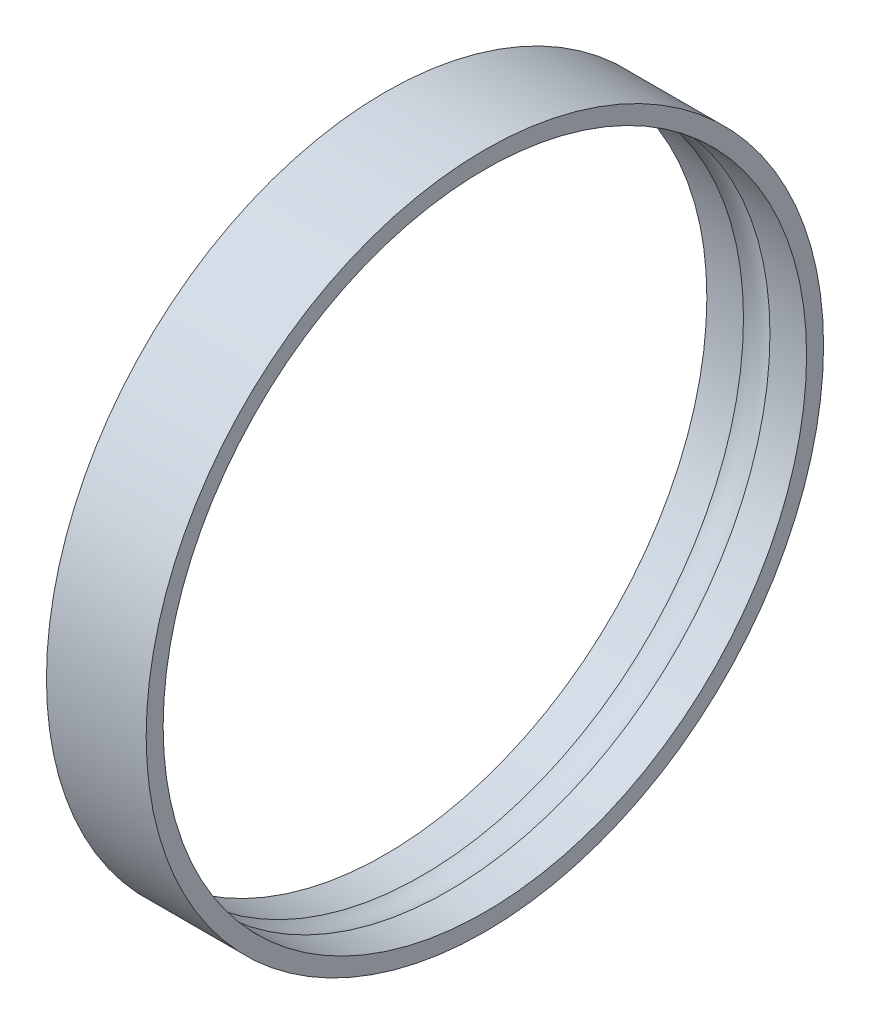
ISO-10303-21;
HEADER;
FILE_DESCRIPTION(('STEP AP214'),'2;1');
FILE_NAME('part.step','',(''),(''),'','','');
FILE_SCHEMA(('AUTOMOTIVE_DESIGN { 1 0 10303 214 1 1 1 1 }'));
ENDSEC;
DATA;
#1=APPLICATION_CONTEXT('core data for automotive mechanical design processes');
#2=APPLICATION_PROTOCOL_DEFINITION('international standard','automotive_design',2000,#1);
#3=PRODUCT_CONTEXT('',#1,'mechanical');
#4=PRODUCT('Part','Part','',(#3));
#5=PRODUCT_RELATED_PRODUCT_CATEGORY('part','',(#4));
#6=PRODUCT_DEFINITION_FORMATION('','',#4);
#7=PRODUCT_DEFINITION_CONTEXT('part definition',#1,'design');
#8=PRODUCT_DEFINITION('design','',#6,#7);
#9=PRODUCT_DEFINITION_SHAPE('','',#8);
#10=(LENGTH_UNIT() NAMED_UNIT(*) SI_UNIT(.MILLI.,.METRE.));
#11=(NAMED_UNIT(*) PLANE_ANGLE_UNIT() SI_UNIT($,.RADIAN.));
#12=(NAMED_UNIT(*) SI_UNIT($,.STERADIAN.) SOLID_ANGLE_UNIT());
#13=UNCERTAINTY_MEASURE_WITH_UNIT(LENGTH_MEASURE(1.E-05),#10,'distance_accuracy_value','');
#14=(GEOMETRIC_REPRESENTATION_CONTEXT(3) GLOBAL_UNCERTAINTY_ASSIGNED_CONTEXT((#13)) GLOBAL_UNIT_ASSIGNED_CONTEXT((#10,
#11,#12)) REPRESENTATION_CONTEXT('',''));
#15=CARTESIAN_POINT('',(0.,0.,0.));
#16=DIRECTION('',(0.,0.,1.));
#17=DIRECTION('',(1.,0.,0.));
#18=AXIS2_PLACEMENT_3D('',#15,#16,#17);
#19=CARTESIAN_POINT('',(64.16,0.,0.));
#20=DIRECTION('',(1.,0.,0.));
#21=DIRECTION('',(0.,0.,-1.));
#22=AXIS2_PLACEMENT_3D('',#19,#20,#21);
#23=TOROIDAL_SURFACE('',#22,69.383,7.15);
#24=CARTESIAN_POINT('',(61.0392611451773,0.,0.));
#25=DIRECTION('',(-1.,0.,0.));
#26=DIRECTION('',(0.,0.,1.));
#27=AXIS2_PLACEMENT_3D('',#24,#25,#26);
#28=CIRCLE('',#27,75.816);
#29=CARTESIAN_POINT('',(61.0392611451773,0.,75.816));
#30=VERTEX_POINT('',#29);
#31=EDGE_CURVE('E31',#30,#30,#28,.T.);
#32=ORIENTED_EDGE('',*,*,#31,.T.);
#33=EDGE_LOOP('',(#32));
#34=FACE_BOUND('',#33,.T.);
#35=CARTESIAN_POINT('',(67.2807388548227,0.,0.));
#36=DIRECTION('',(-1.,0.,0.));
#37=DIRECTION('',(0.,0.,1.));
#38=AXIS2_PLACEMENT_3D('',#35,#36,#37);
#39=CIRCLE('',#38,75.816);
#40=CARTESIAN_POINT('',(67.2807388548227,0.,75.816));
#41=VERTEX_POINT('',#40);
#42=EDGE_CURVE('E36',#41,#41,#39,.F.);
#43=ORIENTED_EDGE('',*,*,#42,.T.);
#44=EDGE_LOOP('',(#43));
#45=FACE_BOUND('',#44,.T.);
#46=ADVANCED_FACE('F15',(#34,#45),#23,.F.);
#47=CARTESIAN_POINT('',(64.16,0.,0.));
#48=DIRECTION('',(-1.,0.,0.));
#49=DIRECTION('',(0.,0.,1.));
#50=AXIS2_PLACEMENT_3D('',#47,#48,#49);
#51=CYLINDRICAL_SURFACE('',#50,75.816);
#52=CARTESIAN_POINT('',(52.41,0.,0.));
#53=DIRECTION('',(-1.,0.,0.));
#54=DIRECTION('',(0.,0.,1.));
#55=AXIS2_PLACEMENT_3D('',#52,#53,#54);
#56=CIRCLE('',#55,75.816);
#57=CARTESIAN_POINT('',(52.41,0.,75.816));
#58=VERTEX_POINT('',#57);
#59=EDGE_CURVE('E19',#58,#58,#56,.F.);
#60=ORIENTED_EDGE('',*,*,#59,.F.);
#61=EDGE_LOOP('',(#60));
#62=FACE_BOUND('',#61,.T.);
#63=ORIENTED_EDGE('',*,*,#31,.F.);
#64=EDGE_LOOP('',(#63));
#65=FACE_BOUND('',#64,.T.);
#66=ADVANCED_FACE('F48',(#62,#65),#51,.F.);
#67=CARTESIAN_POINT('',(64.16,0.,0.));
#68=DIRECTION('',(-1.,0.,0.));
#69=DIRECTION('',(0.,0.,1.));
#70=AXIS2_PLACEMENT_3D('',#67,#68,#69);
#71=CYLINDRICAL_SURFACE('',#70,75.816);
#72=ORIENTED_EDGE('',*,*,#42,.F.);
#73=EDGE_LOOP('',(#72));
#74=FACE_BOUND('',#73,.T.);
#75=CARTESIAN_POINT('',(75.91,0.,0.));
#76=DIRECTION('',(-1.,0.,0.));
#77=DIRECTION('',(0.,0.,1.));
#78=AXIS2_PLACEMENT_3D('',#75,#76,#77);
#79=CIRCLE('',#78,75.816);
#80=CARTESIAN_POINT('',(75.91,0.,75.816));
#81=VERTEX_POINT('',#80);
#82=EDGE_CURVE('E28',#81,#81,#79,.T.);
#83=ORIENTED_EDGE('',*,*,#82,.F.);
#84=EDGE_LOOP('',(#83));
#85=FACE_BOUND('',#84,.T.);
#86=ADVANCED_FACE('F50',(#74,#85),#71,.F.);
#87=CARTESIAN_POINT('',(52.41,0.,77.816));
#88=DIRECTION('',(-1.,0.,0.));
#89=DIRECTION('',(0.,0.,1.));
#90=AXIS2_PLACEMENT_3D('',#87,#88,#89);
#91=PLANE('',#90);
#92=ORIENTED_EDGE('',*,*,#59,.T.);
#93=EDGE_LOOP('',(#92));
#94=FACE_BOUND('',#93,.T.);
#95=CARTESIAN_POINT('',(52.41,0.,0.));
#96=DIRECTION('',(-1.,0.,0.));
#97=DIRECTION('',(0.,0.,1.));
#98=AXIS2_PLACEMENT_3D('',#95,#96,#97);
#99=CIRCLE('',#98,79.816);
#100=CARTESIAN_POINT('',(52.41,0.,79.816));
#101=VERTEX_POINT('',#100);
#102=EDGE_CURVE('E23',#101,#101,#99,.F.);
#103=ORIENTED_EDGE('',*,*,#102,.F.);
#104=EDGE_LOOP('',(#103));
#105=FACE_BOUND('',#104,.T.);
#106=ADVANCED_FACE('F57',(#94,#105),#91,.T.);
#107=CARTESIAN_POINT('',(75.91,0.,77.816));
#108=DIRECTION('',(1.,0.,0.));
#109=DIRECTION('',(0.,0.,-1.));
#110=AXIS2_PLACEMENT_3D('',#107,#108,#109);
#111=PLANE('',#110);
#112=CARTESIAN_POINT('',(75.91,0.,0.));
#113=DIRECTION('',(-1.,0.,0.));
#114=DIRECTION('',(0.,0.,1.));
#115=AXIS2_PLACEMENT_3D('',#112,#113,#114);
#116=CIRCLE('',#115,79.816);
#117=CARTESIAN_POINT('',(75.91,0.,79.816));
#118=VERTEX_POINT('',#117);
#119=EDGE_CURVE('E10',#118,#118,#116,.T.);
#120=ORIENTED_EDGE('',*,*,#119,.F.);
#121=EDGE_LOOP('',(#120));
#122=FACE_BOUND('',#121,.T.);
#123=ORIENTED_EDGE('',*,*,#82,.T.);
#124=EDGE_LOOP('',(#123));
#125=FACE_BOUND('',#124,.T.);
#126=ADVANCED_FACE('F62',(#122,#125),#111,.T.);
#127=CARTESIAN_POINT('',(64.16,0.,0.));
#128=DIRECTION('',(-1.,0.,0.));
#129=DIRECTION('',(0.,0.,1.));
#130=AXIS2_PLACEMENT_3D('',#127,#128,#129);
#131=CYLINDRICAL_SURFACE('',#130,79.816);
#132=ORIENTED_EDGE('',*,*,#102,.T.);
#133=EDGE_LOOP('',(#132));
#134=FACE_BOUND('',#133,.T.);
#135=ORIENTED_EDGE('',*,*,#119,.T.);
#136=EDGE_LOOP('',(#135));
#137=FACE_BOUND('',#136,.T.);
#138=ADVANCED_FACE('F60',(#134,#137),#131,.T.);
#139=CLOSED_SHELL('',(#46,#66,#86,#106,#126,#138));
#140=MANIFOLD_SOLID_BREP('B1',#139);
#141=ADVANCED_BREP_SHAPE_REPRESENTATION('',(#18,#140),#14);
#142=SHAPE_DEFINITION_REPRESENTATION(#9,#141);
ENDSEC;
END-ISO-10303-21;
